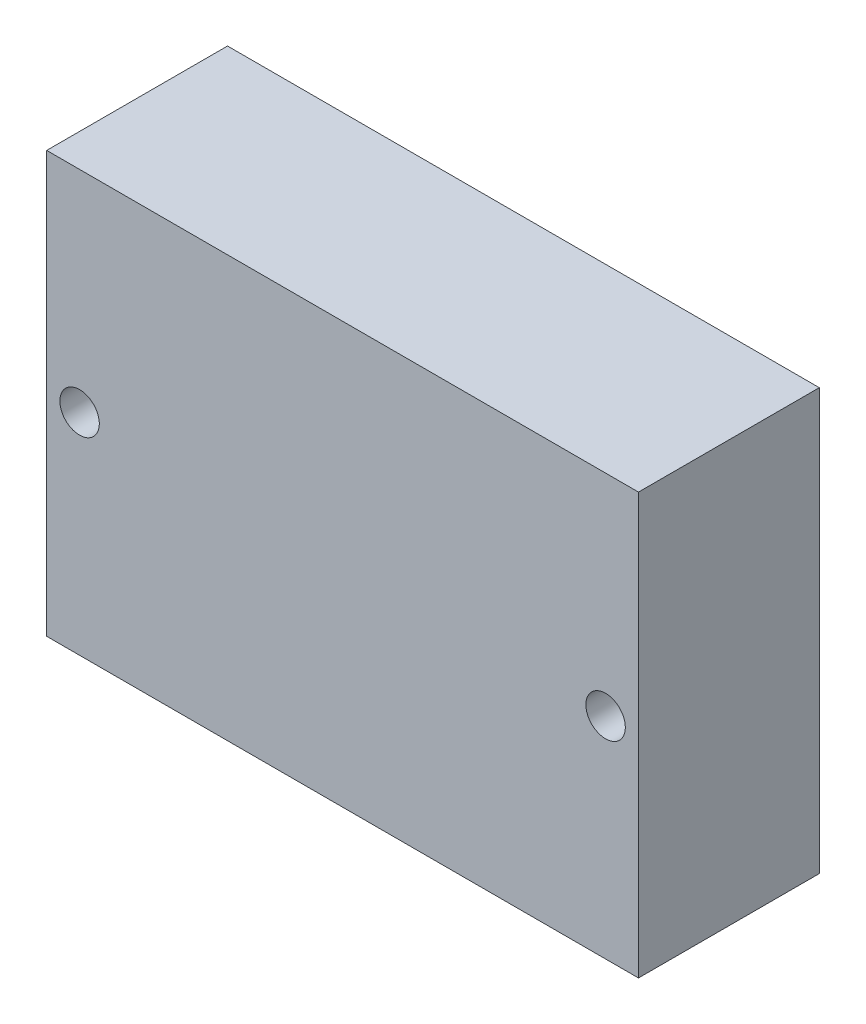
ISO-10303-21;
HEADER;
FILE_DESCRIPTION(('STEP AP214'),'2;1');
FILE_NAME('part.step','',(''),(''),'','','');
FILE_SCHEMA(('AUTOMOTIVE_DESIGN { 1 0 10303 214 1 1 1 1 }'));
ENDSEC;
DATA;
#1=APPLICATION_CONTEXT('core data for automotive mechanical design processes');
#2=APPLICATION_PROTOCOL_DEFINITION('international standard','automotive_design',2000,#1);
#3=PRODUCT_CONTEXT('',#1,'mechanical');
#4=PRODUCT('Part','Part','',(#3));
#5=PRODUCT_RELATED_PRODUCT_CATEGORY('part','',(#4));
#6=PRODUCT_DEFINITION_FORMATION('','',#4);
#7=PRODUCT_DEFINITION_CONTEXT('part definition',#1,'design');
#8=PRODUCT_DEFINITION('design','',#6,#7);
#9=PRODUCT_DEFINITION_SHAPE('','',#8);
#10=(LENGTH_UNIT() NAMED_UNIT(*) SI_UNIT(.MILLI.,.METRE.));
#11=(NAMED_UNIT(*) PLANE_ANGLE_UNIT() SI_UNIT($,.RADIAN.));
#12=(NAMED_UNIT(*) SI_UNIT($,.STERADIAN.) SOLID_ANGLE_UNIT());
#13=UNCERTAINTY_MEASURE_WITH_UNIT(LENGTH_MEASURE(1.E-05),#10,'distance_accuracy_value','');
#14=(GEOMETRIC_REPRESENTATION_CONTEXT(3) GLOBAL_UNCERTAINTY_ASSIGNED_CONTEXT((#13)) GLOBAL_UNIT_ASSIGNED_CONTEXT((#10,
#11,#12)) REPRESENTATION_CONTEXT('',''));
#15=CARTESIAN_POINT('',(0.,0.,0.));
#16=DIRECTION('',(0.,0.,1.));
#17=DIRECTION('',(1.,0.,0.));
#18=AXIS2_PLACEMENT_3D('',#15,#16,#17);
#19=CARTESIAN_POINT('',(0.,0.,13.75));
#20=DIRECTION('',(0.,0.,1.));
#21=DIRECTION('',(1.,0.,0.));
#22=AXIS2_PLACEMENT_3D('',#19,#20,#21);
#23=PLANE('',#22);
#24=CARTESIAN_POINT('',(54.65,-24.64,13.75));
#25=DIRECTION('',(0.,0.,1.));
#26=DIRECTION('',(1.,0.,0.));
#27=AXIS2_PLACEMENT_3D('',#24,#25,#26);
#28=CIRCLE('',#27,1.5);
#29=CARTESIAN_POINT('',(56.15,-24.64,13.75));
#30=VERTEX_POINT('',#29);
#31=EDGE_CURVE('E112',#30,#30,#28,.T.);
#32=ORIENTED_EDGE('',*,*,#31,.F.);
#33=EDGE_LOOP('',(#32));
#34=FACE_BOUND('',#33,.T.);
#35=DIRECTION('',(0.,1.,0.));
#36=VECTOR('',#35,1.);
#37=CARTESIAN_POINT('',(57.15,-8.64,13.75));
#38=LINE('',#37,#36);
#39=CARTESIAN_POINT('',(57.15,-40.64,13.75));
#40=VERTEX_POINT('',#39);
#41=CARTESIAN_POINT('',(57.15,-8.64,13.75));
#42=VERTEX_POINT('',#41);
#43=EDGE_CURVE('E92',#40,#42,#38,.T.);
#44=ORIENTED_EDGE('',*,*,#43,.T.);
#45=DIRECTION('',(-1.,0.,0.));
#46=VECTOR('',#45,1.);
#47=CARTESIAN_POINT('',(12.15,-8.64,13.75));
#48=LINE('',#47,#46);
#49=CARTESIAN_POINT('',(12.15,-8.64,13.75));
#50=VERTEX_POINT('',#49);
#51=EDGE_CURVE('E87',#42,#50,#48,.T.);
#52=ORIENTED_EDGE('',*,*,#51,.T.);
#53=DIRECTION('',(0.,-1.,0.));
#54=VECTOR('',#53,1.);
#55=CARTESIAN_POINT('',(12.15,-8.64,13.75));
#56=LINE('',#55,#54);
#57=CARTESIAN_POINT('',(12.15,-40.64,13.75));
#58=VERTEX_POINT('',#57);
#59=EDGE_CURVE('E90',#50,#58,#56,.T.);
#60=ORIENTED_EDGE('',*,*,#59,.T.);
#61=DIRECTION('',(1.,0.,0.));
#62=VECTOR('',#61,1.);
#63=CARTESIAN_POINT('',(12.15,-40.64,13.75));
#64=LINE('',#63,#62);
#65=EDGE_CURVE('E57',#58,#40,#64,.T.);
#66=ORIENTED_EDGE('',*,*,#65,.T.);
#67=EDGE_LOOP('',(#44,#52,#60,#66));
#68=FACE_BOUND('',#67,.T.);
#69=CARTESIAN_POINT('',(14.65,-24.64,13.75));
#70=DIRECTION('',(0.,0.,1.));
#71=DIRECTION('',(-1.,0.,0.));
#72=AXIS2_PLACEMENT_3D('',#69,#70,#71);
#73=CIRCLE('',#72,1.5);
#74=CARTESIAN_POINT('',(13.15,-24.64,13.75));
#75=VERTEX_POINT('',#74);
#76=EDGE_CURVE('E134',#75,#75,#73,.T.);
#77=ORIENTED_EDGE('',*,*,#76,.F.);
#78=EDGE_LOOP('',(#77));
#79=FACE_BOUND('',#78,.T.);
#80=ADVANCED_FACE('F39',(#34,#68,#79),#23,.T.);
#81=CARTESIAN_POINT('',(0.,0.,0.));
#82=DIRECTION('',(0.,0.,1.));
#83=DIRECTION('',(1.,0.,0.));
#84=AXIS2_PLACEMENT_3D('',#81,#82,#83);
#85=PLANE('',#84);
#86=DIRECTION('',(0.,1.,0.));
#87=VECTOR('',#86,1.);
#88=CARTESIAN_POINT('',(57.15,-8.64,0.));
#89=LINE('',#88,#87);
#90=CARTESIAN_POINT('',(57.15,-40.64,0.));
#91=VERTEX_POINT('',#90);
#92=CARTESIAN_POINT('',(57.15,-8.64,0.));
#93=VERTEX_POINT('',#92);
#94=EDGE_CURVE('E108',#91,#93,#89,.T.);
#95=ORIENTED_EDGE('',*,*,#94,.F.);
#96=DIRECTION('',(1.,0.,0.));
#97=VECTOR('',#96,1.);
#98=CARTESIAN_POINT('',(12.15,-40.64,0.));
#99=LINE('',#98,#97);
#100=CARTESIAN_POINT('',(12.15,-40.64,0.));
#101=VERTEX_POINT('',#100);
#102=EDGE_CURVE('E80',#101,#91,#99,.T.);
#103=ORIENTED_EDGE('',*,*,#102,.F.);
#104=DIRECTION('',(0.,-1.,0.));
#105=VECTOR('',#104,1.);
#106=CARTESIAN_POINT('',(12.15,-8.64,0.));
#107=LINE('',#106,#105);
#108=CARTESIAN_POINT('',(12.15,-8.64,0.));
#109=VERTEX_POINT('',#108);
#110=EDGE_CURVE('E74',#109,#101,#107,.T.);
#111=ORIENTED_EDGE('',*,*,#110,.F.);
#112=DIRECTION('',(-1.,0.,0.));
#113=VECTOR('',#112,1.);
#114=CARTESIAN_POINT('',(12.15,-8.64,0.));
#115=LINE('',#114,#113);
#116=EDGE_CURVE('E97',#93,#109,#115,.T.);
#117=ORIENTED_EDGE('',*,*,#116,.F.);
#118=EDGE_LOOP('',(#95,#103,#111,#117));
#119=FACE_BOUND('',#118,.T.);
#120=CARTESIAN_POINT('',(54.65,-24.64,0.));
#121=DIRECTION('',(0.,0.,1.));
#122=DIRECTION('',(1.,0.,0.));
#123=AXIS2_PLACEMENT_3D('',#120,#121,#122);
#124=CIRCLE('',#123,1.5);
#125=CARTESIAN_POINT('',(56.15,-24.64,0.));
#126=VERTEX_POINT('',#125);
#127=EDGE_CURVE('E130',#126,#126,#124,.T.);
#128=ORIENTED_EDGE('',*,*,#127,.T.);
#129=EDGE_LOOP('',(#128));
#130=FACE_BOUND('',#129,.T.);
#131=CARTESIAN_POINT('',(14.65,-24.64,0.));
#132=DIRECTION('',(0.,0.,1.));
#133=DIRECTION('',(-1.,0.,0.));
#134=AXIS2_PLACEMENT_3D('',#131,#132,#133);
#135=CIRCLE('',#134,1.5);
#136=CARTESIAN_POINT('',(13.15,-24.64,0.));
#137=VERTEX_POINT('',#136);
#138=EDGE_CURVE('E138',#137,#137,#135,.T.);
#139=ORIENTED_EDGE('',*,*,#138,.T.);
#140=EDGE_LOOP('',(#139));
#141=FACE_BOUND('',#140,.T.);
#142=ADVANCED_FACE('F125',(#119,#130,#141),#85,.F.);
#143=CARTESIAN_POINT('',(57.15,-8.64,13.75));
#144=DIRECTION('',(-1.,0.,0.));
#145=DIRECTION('',(0.,0.,1.));
#146=AXIS2_PLACEMENT_3D('',#143,#144,#145);
#147=PLANE('',#146);
#148=ORIENTED_EDGE('',*,*,#94,.T.);
#149=DIRECTION('',(0.,0.,-1.));
#150=VECTOR('',#149,1.);
#151=CARTESIAN_POINT('',(57.15,-8.64,13.75));
#152=LINE('',#151,#150);
#153=EDGE_CURVE('E11',#42,#93,#152,.T.);
#154=ORIENTED_EDGE('',*,*,#153,.F.);
#155=ORIENTED_EDGE('',*,*,#43,.F.);
#156=DIRECTION('',(0.,0.,-1.));
#157=VECTOR('',#156,1.);
#158=CARTESIAN_POINT('',(57.15,-40.64,13.75));
#159=LINE('',#158,#157);
#160=EDGE_CURVE('E104',#40,#91,#159,.T.);
#161=ORIENTED_EDGE('',*,*,#160,.T.);
#162=EDGE_LOOP('',(#148,#154,#155,#161));
#163=FACE_BOUND('',#162,.T.);
#164=ADVANCED_FACE('F41',(#163),#147,.F.);
#165=CARTESIAN_POINT('',(12.15,-8.64,13.75));
#166=DIRECTION('',(0.,-1.,0.));
#167=DIRECTION('',(0.,0.,-1.));
#168=AXIS2_PLACEMENT_3D('',#165,#166,#167);
#169=PLANE('',#168);
#170=ORIENTED_EDGE('',*,*,#116,.T.);
#171=DIRECTION('',(0.,0.,-1.));
#172=VECTOR('',#171,1.);
#173=CARTESIAN_POINT('',(12.15,-8.64,13.75));
#174=LINE('',#173,#172);
#175=EDGE_CURVE('E49',#50,#109,#174,.T.);
#176=ORIENTED_EDGE('',*,*,#175,.F.);
#177=ORIENTED_EDGE('',*,*,#51,.F.);
#178=ORIENTED_EDGE('',*,*,#153,.T.);
#179=EDGE_LOOP('',(#170,#176,#177,#178));
#180=FACE_BOUND('',#179,.T.);
#181=ADVANCED_FACE('F96',(#180),#169,.F.);
#182=CARTESIAN_POINT('',(12.15,-8.64,13.75));
#183=DIRECTION('',(1.,0.,0.));
#184=DIRECTION('',(0.,0.,-1.));
#185=AXIS2_PLACEMENT_3D('',#182,#183,#184);
#186=PLANE('',#185);
#187=ORIENTED_EDGE('',*,*,#110,.T.);
#188=DIRECTION('',(0.,0.,-1.));
#189=VECTOR('',#188,1.);
#190=CARTESIAN_POINT('',(12.15,-40.64,13.75));
#191=LINE('',#190,#189);
#192=EDGE_CURVE('E99',#58,#101,#191,.T.);
#193=ORIENTED_EDGE('',*,*,#192,.F.);
#194=ORIENTED_EDGE('',*,*,#59,.F.);
#195=ORIENTED_EDGE('',*,*,#175,.T.);
#196=EDGE_LOOP('',(#187,#193,#194,#195));
#197=FACE_BOUND('',#196,.T.);
#198=ADVANCED_FACE('F100',(#197),#186,.F.);
#199=CARTESIAN_POINT('',(12.15,-40.64,13.75));
#200=DIRECTION('',(0.,1.,0.));
#201=DIRECTION('',(0.,0.,1.));
#202=AXIS2_PLACEMENT_3D('',#199,#200,#201);
#203=PLANE('',#202);
#204=ORIENTED_EDGE('',*,*,#102,.T.);
#205=ORIENTED_EDGE('',*,*,#160,.F.);
#206=ORIENTED_EDGE('',*,*,#65,.F.);
#207=ORIENTED_EDGE('',*,*,#192,.T.);
#208=EDGE_LOOP('',(#204,#205,#206,#207));
#209=FACE_BOUND('',#208,.T.);
#210=ADVANCED_FACE('F122',(#209),#203,.F.);
#211=CARTESIAN_POINT('',(54.65,-24.64,13.75));
#212=DIRECTION('',(0.,0.,-1.));
#213=DIRECTION('',(-1.,0.,0.));
#214=AXIS2_PLACEMENT_3D('',#211,#212,#213);
#215=CYLINDRICAL_SURFACE('',#214,1.5);
#216=ORIENTED_EDGE('',*,*,#31,.T.);
#217=EDGE_LOOP('',(#216));
#218=FACE_BOUND('',#217,.T.);
#219=ORIENTED_EDGE('',*,*,#127,.F.);
#220=EDGE_LOOP('',(#219));
#221=FACE_BOUND('',#220,.T.);
#222=ADVANCED_FACE('F157',(#218,#221),#215,.F.);
#223=CARTESIAN_POINT('',(14.65,-24.64,13.75));
#224=DIRECTION('',(0.,0.,-1.));
#225=DIRECTION('',(-1.,0.,0.));
#226=AXIS2_PLACEMENT_3D('',#223,#224,#225);
#227=CYLINDRICAL_SURFACE('',#226,1.5);
#228=ORIENTED_EDGE('',*,*,#76,.T.);
#229=EDGE_LOOP('',(#228));
#230=FACE_BOUND('',#229,.T.);
#231=ORIENTED_EDGE('',*,*,#138,.F.);
#232=EDGE_LOOP('',(#231));
#233=FACE_BOUND('',#232,.T.);
#234=ADVANCED_FACE('F146',(#230,#233),#227,.F.);
#235=CLOSED_SHELL('',(#80,#142,#164,#181,#198,#210,#222,#234));
#236=MANIFOLD_SOLID_BREP('B2',#235);
#237=ADVANCED_BREP_SHAPE_REPRESENTATION('',(#18,#236),#14);
#238=SHAPE_DEFINITION_REPRESENTATION(#9,#237);
ENDSEC;
END-ISO-10303-21;
